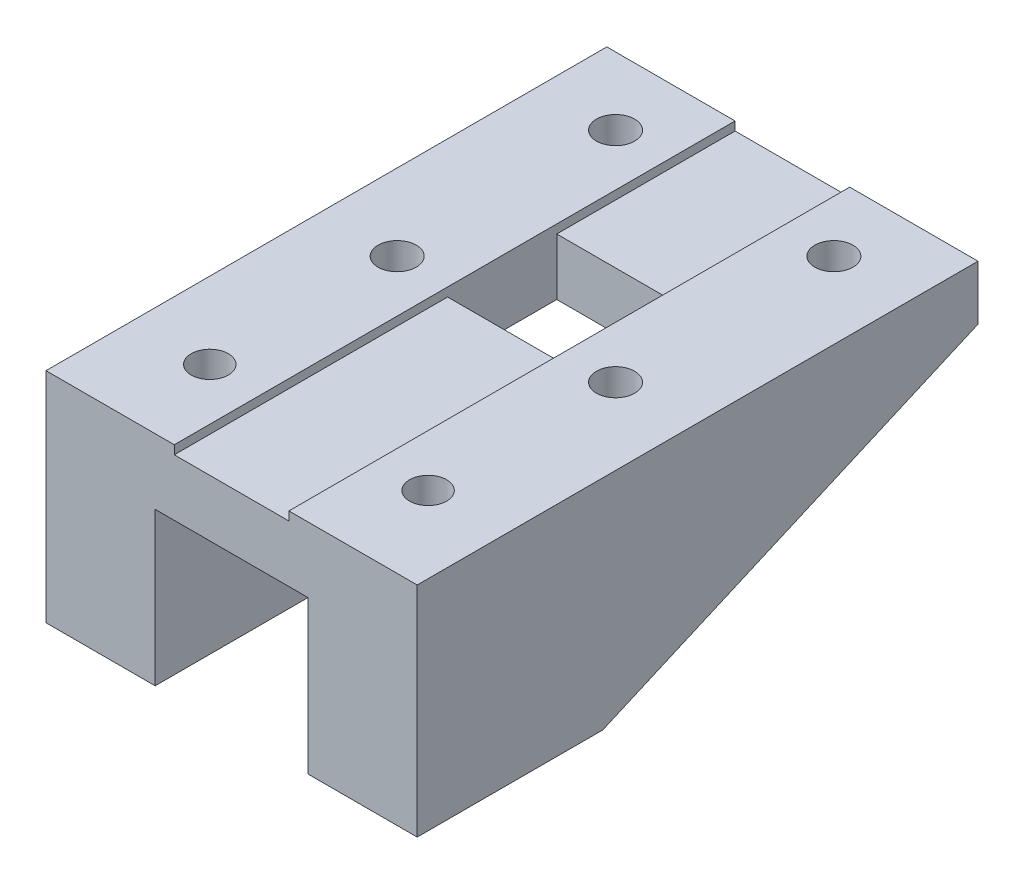
ISO-10303-21;
HEADER;
FILE_DESCRIPTION(('STEP AP214'),'2;1');
FILE_NAME('part.step','',(''),(''),'','','');
FILE_SCHEMA(('AUTOMOTIVE_DESIGN { 1 0 10303 214 1 1 1 1 }'));
ENDSEC;
DATA;
#1=APPLICATION_CONTEXT('core data for automotive mechanical design processes');
#2=APPLICATION_PROTOCOL_DEFINITION('international standard','automotive_design',2000,#1);
#3=PRODUCT_CONTEXT('',#1,'mechanical');
#4=PRODUCT('Part','Part','',(#3));
#5=PRODUCT_RELATED_PRODUCT_CATEGORY('part','',(#4));
#6=PRODUCT_DEFINITION_FORMATION('','',#4);
#7=PRODUCT_DEFINITION_CONTEXT('part definition',#1,'design');
#8=PRODUCT_DEFINITION('design','',#6,#7);
#9=PRODUCT_DEFINITION_SHAPE('','',#8);
#10=(LENGTH_UNIT() NAMED_UNIT(*) SI_UNIT(.MILLI.,.METRE.));
#11=(NAMED_UNIT(*) PLANE_ANGLE_UNIT() SI_UNIT($,.RADIAN.));
#12=(NAMED_UNIT(*) SI_UNIT($,.STERADIAN.) SOLID_ANGLE_UNIT());
#13=UNCERTAINTY_MEASURE_WITH_UNIT(LENGTH_MEASURE(1.E-05),#10,'distance_accuracy_value','');
#14=(GEOMETRIC_REPRESENTATION_CONTEXT(3) GLOBAL_UNCERTAINTY_ASSIGNED_CONTEXT((#13)) GLOBAL_UNIT_ASSIGNED_CONTEXT((#10,
#11,#12)) REPRESENTATION_CONTEXT('',''));
#15=CARTESIAN_POINT('',(0.,0.,0.));
#16=DIRECTION('',(0.,0.,1.));
#17=DIRECTION('',(1.,0.,0.));
#18=AXIS2_PLACEMENT_3D('',#15,#16,#17);
#19=CARTESIAN_POINT('',(-10.,142.,-122.46692088768));
#20=DIRECTION('',(0.,-1.,0.));
#21=DIRECTION('',(1.,0.,0.));
#22=AXIS2_PLACEMENT_3D('',#19,#20,#21);
#23=CYLINDRICAL_SURFACE('',#22,1.75);
#24=CARTESIAN_POINT('',(-10.,137.,-122.46692088768));
#25=DIRECTION('',(0.,1.,0.));
#26=DIRECTION('',(1.,0.,0.));
#27=AXIS2_PLACEMENT_3D('',#24,#25,#26);
#28=CIRCLE('',#27,1.75);
#29=CARTESIAN_POINT('',(-11.75,137.,-122.46692088768));
#30=VERTEX_POINT('',#29);
#31=EDGE_CURVE('E384',#30,#30,#28,.T.);
#32=ORIENTED_EDGE('',*,*,#31,.F.);
#33=DIRECTION('',(0.,1.,0.));
#34=VECTOR('',#33,1.);
#35=CARTESIAN_POINT('',(-11.75,142.,-122.46692088768));
#36=LINE('',#35,#34);
#37=CARTESIAN_POINT('',(-11.75,142.,-122.46692088768));
#38=VERTEX_POINT('',#37);
#39=EDGE_CURVE('E11',#30,#38,#36,.T.);
#40=ORIENTED_EDGE('',*,*,#39,.T.);
#41=CARTESIAN_POINT('',(-10.,142.,-122.46692088768));
#42=DIRECTION('',(0.,1.,0.));
#43=DIRECTION('',(1.,0.,0.));
#44=AXIS2_PLACEMENT_3D('',#41,#42,#43);
#45=CIRCLE('',#44,1.75);
#46=EDGE_CURVE('E486',#38,#38,#45,.T.);
#47=ORIENTED_EDGE('',*,*,#46,.T.);
#48=ORIENTED_EDGE('',*,*,#39,.F.);
#49=EDGE_LOOP('',(#32,#40,#47,#48));
#50=FACE_BOUND('',#49,.T.);
#51=ADVANCED_FACE('F16',(#50),#23,.F.);
#52=CARTESIAN_POINT('',(10.,142.,-142.46692088768));
#53=DIRECTION('',(0.,-1.,0.));
#54=DIRECTION('',(1.,0.,0.));
#55=AXIS2_PLACEMENT_3D('',#52,#53,#54);
#56=CYLINDRICAL_SURFACE('',#55,1.75);
#57=CARTESIAN_POINT('',(10.,137.,-142.46692088768));
#58=DIRECTION('',(0.,1.,0.));
#59=DIRECTION('',(1.,0.,0.));
#60=AXIS2_PLACEMENT_3D('',#57,#58,#59);
#61=CIRCLE('',#60,1.75);
#62=CARTESIAN_POINT('',(8.25,137.,-142.46692088768));
#63=VERTEX_POINT('',#62);
#64=EDGE_CURVE('E382',#63,#63,#61,.T.);
#65=ORIENTED_EDGE('',*,*,#64,.F.);
#66=DIRECTION('',(0.,1.,0.));
#67=VECTOR('',#66,1.);
#68=CARTESIAN_POINT('',(8.25,142.,-142.46692088768));
#69=LINE('',#68,#67);
#70=CARTESIAN_POINT('',(8.25,142.,-142.46692088768));
#71=VERTEX_POINT('',#70);
#72=EDGE_CURVE('E26',#63,#71,#69,.T.);
#73=ORIENTED_EDGE('',*,*,#72,.T.);
#74=CARTESIAN_POINT('',(10.,142.,-142.46692088768));
#75=DIRECTION('',(0.,1.,0.));
#76=DIRECTION('',(1.,0.,0.));
#77=AXIS2_PLACEMENT_3D('',#74,#75,#76);
#78=CIRCLE('',#77,1.75);
#79=EDGE_CURVE('E482',#71,#71,#78,.T.);
#80=ORIENTED_EDGE('',*,*,#79,.T.);
#81=ORIENTED_EDGE('',*,*,#72,.F.);
#82=EDGE_LOOP('',(#65,#73,#80,#81));
#83=FACE_BOUND('',#82,.T.);
#84=ADVANCED_FACE('F1242',(#83),#56,.F.);
#85=CARTESIAN_POINT('',(10.,142.,-122.46692088768));
#86=DIRECTION('',(0.,-1.,0.));
#87=DIRECTION('',(1.,0.,0.));
#88=AXIS2_PLACEMENT_3D('',#85,#86,#87);
#89=CYLINDRICAL_SURFACE('',#88,1.75);
#90=CARTESIAN_POINT('',(10.,137.,-122.46692088768));
#91=DIRECTION('',(0.,1.,0.));
#92=DIRECTION('',(1.,0.,0.));
#93=AXIS2_PLACEMENT_3D('',#90,#91,#92);
#94=CIRCLE('',#93,1.75);
#95=CARTESIAN_POINT('',(8.25,137.,-122.46692088768));
#96=VERTEX_POINT('',#95);
#97=EDGE_CURVE('E378',#96,#96,#94,.T.);
#98=ORIENTED_EDGE('',*,*,#97,.F.);
#99=DIRECTION('',(0.,1.,0.));
#100=VECTOR('',#99,1.);
#101=CARTESIAN_POINT('',(8.25,142.,-122.46692088768));
#102=LINE('',#101,#100);
#103=CARTESIAN_POINT('',(8.25,142.,-122.46692088768));
#104=VERTEX_POINT('',#103);
#105=EDGE_CURVE('E353',#96,#104,#102,.T.);
#106=ORIENTED_EDGE('',*,*,#105,.T.);
#107=CARTESIAN_POINT('',(10.,142.,-122.46692088768));
#108=DIRECTION('',(0.,1.,0.));
#109=DIRECTION('',(1.,0.,0.));
#110=AXIS2_PLACEMENT_3D('',#107,#108,#109);
#111=CIRCLE('',#110,1.75);
#112=EDGE_CURVE('E334',#104,#104,#111,.T.);
#113=ORIENTED_EDGE('',*,*,#112,.T.);
#114=ORIENTED_EDGE('',*,*,#105,.F.);
#115=EDGE_LOOP('',(#98,#106,#113,#114));
#116=FACE_BOUND('',#115,.T.);
#117=ADVANCED_FACE('F1236',(#116),#89,.F.);
#118=CARTESIAN_POINT('',(-10.,142.,-142.46692088768));
#119=DIRECTION('',(0.,-1.,0.));
#120=DIRECTION('',(1.,0.,0.));
#121=AXIS2_PLACEMENT_3D('',#118,#119,#120);
#122=CYLINDRICAL_SURFACE('',#121,1.75);
#123=CARTESIAN_POINT('',(-10.,137.,-142.46692088768));
#124=DIRECTION('',(0.,1.,0.));
#125=DIRECTION('',(1.,0.,0.));
#126=AXIS2_PLACEMENT_3D('',#123,#124,#125);
#127=CIRCLE('',#126,1.75);
#128=CARTESIAN_POINT('',(-11.75,137.,-142.46692088768));
#129=VERTEX_POINT('',#128);
#130=EDGE_CURVE('E359',#129,#129,#127,.T.);
#131=ORIENTED_EDGE('',*,*,#130,.F.);
#132=DIRECTION('',(0.,1.,0.));
#133=VECTOR('',#132,1.);
#134=CARTESIAN_POINT('',(-11.75,142.,-142.46692088768));
#135=LINE('',#134,#133);
#136=CARTESIAN_POINT('',(-11.75,142.,-142.46692088768));
#137=VERTEX_POINT('',#136);
#138=EDGE_CURVE('E323',#129,#137,#135,.T.);
#139=ORIENTED_EDGE('',*,*,#138,.T.);
#140=CARTESIAN_POINT('',(-10.,142.,-142.46692088768));
#141=DIRECTION('',(0.,1.,0.));
#142=DIRECTION('',(1.,0.,0.));
#143=AXIS2_PLACEMENT_3D('',#140,#141,#142);
#144=CIRCLE('',#143,1.75);
#145=EDGE_CURVE('E490',#137,#137,#144,.T.);
#146=ORIENTED_EDGE('',*,*,#145,.T.);
#147=ORIENTED_EDGE('',*,*,#138,.F.);
#148=EDGE_LOOP('',(#131,#139,#146,#147));
#149=FACE_BOUND('',#148,.T.);
#150=ADVANCED_FACE('F1241',(#149),#122,.F.);
#151=CARTESIAN_POINT('',(0.,141.2,-127.333461333067));
#152=DIRECTION('',(0.,-1.,0.));
#153=DIRECTION('',(0.,0.,-1.));
#154=AXIS2_PLACEMENT_3D('',#151,#152,#153);
#155=PLANE('',#154);
#156=DIRECTION('',(1.,0.,0.));
#157=VECTOR('',#156,1.);
#158=CARTESIAN_POINT('',(-2.525,141.2,-132.333461333067));
#159=LINE('',#158,#157);
#160=CARTESIAN_POINT('',(-5.25,141.2,-132.333461333067));
#161=VERTEX_POINT('',#160);
#162=CARTESIAN_POINT('',(5.25,141.2,-132.333461333067));
#163=VERTEX_POINT('',#162);
#164=EDGE_CURVE('E324',#161,#163,#159,.T.);
#165=ORIENTED_EDGE('',*,*,#164,.T.);
#166=DIRECTION('',(0.,0.,-1.));
#167=VECTOR('',#166,1.);
#168=CARTESIAN_POINT('',(5.25,141.2,-148.66692088768));
#169=LINE('',#168,#167);
#170=CARTESIAN_POINT('',(5.25,141.2,-148.66692088768));
#171=VERTEX_POINT('',#170);
#172=EDGE_CURVE('E345',#163,#171,#169,.T.);
#173=ORIENTED_EDGE('',*,*,#172,.T.);
#174=DIRECTION('',(1.,0.,0.));
#175=VECTOR('',#174,1.);
#176=CARTESIAN_POINT('',(-2.47499083755879,141.2,-148.66692088768));
#177=LINE('',#176,#175);
#178=CARTESIAN_POINT('',(-5.25,141.2,-148.66692088768));
#179=VERTEX_POINT('',#178);
#180=EDGE_CURVE('E403',#179,#171,#177,.T.);
#181=ORIENTED_EDGE('',*,*,#180,.F.);
#182=DIRECTION('',(0.,0.,1.));
#183=VECTOR('',#182,1.);
#184=CARTESIAN_POINT('',(-5.25,141.2,-106.000001778454));
#185=LINE('',#184,#183);
#186=EDGE_CURVE('E471',#179,#161,#185,.T.);
#187=ORIENTED_EDGE('',*,*,#186,.T.);
#188=EDGE_LOOP('',(#165,#173,#181,#187));
#189=FACE_BOUND('',#188,.T.);
#190=ADVANCED_FACE('F1073',(#189),#155,.F.);
#191=CARTESIAN_POINT('',(0.,141.2,-127.333461333067));
#192=DIRECTION('',(0.,-1.,0.));
#193=DIRECTION('',(0.,0.,-1.));
#194=AXIS2_PLACEMENT_3D('',#191,#192,#193);
#195=PLANE('',#194);
#196=DIRECTION('',(-1.,0.,0.));
#197=VECTOR('',#196,1.);
#198=CARTESIAN_POINT('',(2.525,141.2,-122.333461333067));
#199=LINE('',#198,#197);
#200=CARTESIAN_POINT('',(5.25,141.2,-122.333461333067));
#201=VERTEX_POINT('',#200);
#202=CARTESIAN_POINT('',(-5.25,141.2,-122.333461333067));
#203=VERTEX_POINT('',#202);
#204=EDGE_CURVE('E312',#201,#203,#199,.T.);
#205=ORIENTED_EDGE('',*,*,#204,.T.);
#206=DIRECTION('',(0.,0.,1.));
#207=VECTOR('',#206,1.);
#208=CARTESIAN_POINT('',(-5.25,141.2,-106.000001778454));
#209=LINE('',#208,#207);
#210=CARTESIAN_POINT('',(-5.25,141.2,-97.3000017784545));
#211=VERTEX_POINT('',#210);
#212=EDGE_CURVE('E449',#203,#211,#209,.T.);
#213=ORIENTED_EDGE('',*,*,#212,.T.);
#214=DIRECTION('',(-1.,0.,0.));
#215=VECTOR('',#214,1.);
#216=CARTESIAN_POINT('',(9.02500009685755,141.2,-97.3000017784545));
#217=LINE('',#216,#215);
#218=CARTESIAN_POINT('',(5.25,141.2,-97.3000017784545));
#219=VERTEX_POINT('',#218);
#220=EDGE_CURVE('E330',#219,#211,#217,.T.);
#221=ORIENTED_EDGE('',*,*,#220,.F.);
#222=DIRECTION('',(0.,0.,-1.));
#223=VECTOR('',#222,1.);
#224=CARTESIAN_POINT('',(5.25,141.2,-106.000001778454));
#225=LINE('',#224,#223);
#226=EDGE_CURVE('E327',#219,#201,#225,.T.);
#227=ORIENTED_EDGE('',*,*,#226,.T.);
#228=EDGE_LOOP('',(#205,#213,#221,#227));
#229=FACE_BOUND('',#228,.T.);
#230=ADVANCED_FACE('F328',(#229),#195,.F.);
#231=CARTESIAN_POINT('',(5.05,141.2,-122.333461333067));
#232=DIRECTION('',(0.,0.,1.));
#233=DIRECTION('',(1.,0.,0.));
#234=AXIS2_PLACEMENT_3D('',#231,#232,#233);
#235=PLANE('',#234);
#236=DIRECTION('',(0.,1.,0.));
#237=VECTOR('',#236,1.);
#238=CARTESIAN_POINT('',(-5.25,141.2,-122.333461333067));
#239=LINE('',#238,#237);
#240=CARTESIAN_POINT('',(-5.25,136.,-122.333461333067));
#241=VERTEX_POINT('',#240);
#242=EDGE_CURVE('E318',#241,#203,#239,.T.);
#243=ORIENTED_EDGE('',*,*,#242,.T.);
#244=ORIENTED_EDGE('',*,*,#204,.F.);
#245=DIRECTION('',(0.,-1.,0.));
#246=VECTOR('',#245,1.);
#247=CARTESIAN_POINT('',(5.25,137.,-122.333461333067));
#248=LINE('',#247,#246);
#249=CARTESIAN_POINT('',(5.25,136.,-122.333461333067));
#250=VERTEX_POINT('',#249);
#251=EDGE_CURVE('E317',#201,#250,#248,.T.);
#252=ORIENTED_EDGE('',*,*,#251,.T.);
#253=DIRECTION('',(1.,0.,0.));
#254=VECTOR('',#253,1.);
#255=CARTESIAN_POINT('',(-5.25,136.,-122.333461333067));
#256=LINE('',#255,#254);
#257=EDGE_CURVE('E485',#241,#250,#256,.T.);
#258=ORIENTED_EDGE('',*,*,#257,.F.);
#259=EDGE_LOOP('',(#243,#244,#252,#258));
#260=FACE_BOUND('',#259,.T.);
#261=ADVANCED_FACE('F314',(#260),#235,.F.);
#262=CARTESIAN_POINT('',(-5.05,141.2,-132.333461333067));
#263=DIRECTION('',(0.,0.,-1.));
#264=DIRECTION('',(0.,-1.,0.));
#265=AXIS2_PLACEMENT_3D('',#262,#263,#264);
#266=PLANE('',#265);
#267=DIRECTION('',(0.,1.,0.));
#268=VECTOR('',#267,1.);
#269=CARTESIAN_POINT('',(5.25,141.2,-132.333461333067));
#270=LINE('',#269,#268);
#271=CARTESIAN_POINT('',(5.25,136.,-132.333461333067));
#272=VERTEX_POINT('',#271);
#273=EDGE_CURVE('E265',#272,#163,#270,.T.);
#274=ORIENTED_EDGE('',*,*,#273,.T.);
#275=ORIENTED_EDGE('',*,*,#164,.F.);
#276=DIRECTION('',(0.,-1.,0.));
#277=VECTOR('',#276,1.);
#278=CARTESIAN_POINT('',(-5.25,137.,-132.333461333067));
#279=LINE('',#278,#277);
#280=CARTESIAN_POINT('',(-5.25,136.,-132.333461333067));
#281=VERTEX_POINT('',#280);
#282=EDGE_CURVE('E448',#161,#281,#279,.T.);
#283=ORIENTED_EDGE('',*,*,#282,.T.);
#284=DIRECTION('',(-1.,0.,0.));
#285=VECTOR('',#284,1.);
#286=CARTESIAN_POINT('',(5.25,136.,-132.333461333067));
#287=LINE('',#286,#285);
#288=EDGE_CURVE('E434',#272,#281,#287,.T.);
#289=ORIENTED_EDGE('',*,*,#288,.F.);
#290=EDGE_LOOP('',(#274,#275,#283,#289));
#291=FACE_BOUND('',#290,.T.);
#292=ADVANCED_FACE('F1152',(#291),#266,.F.);
#293=CARTESIAN_POINT('',(-10.0000001490116,122.,-108.300001778455));
#294=DIRECTION('',(0.,-1.,0.));
#295=DIRECTION('',(0.,0.,-1.));
#296=AXIS2_PLACEMENT_3D('',#293,#294,#295);
#297=PLANE('',#296);
#298=CARTESIAN_POINT('',(-10.0000001490116,122.,-105.300001778455));
#299=DIRECTION('',(0.,1.,0.));
#300=DIRECTION('',(1.,0.,0.));
#301=AXIS2_PLACEMENT_3D('',#298,#299,#300);
#302=CIRCLE('',#301,1.7);
#303=CARTESIAN_POINT('',(-11.7000001490116,122.,-105.300001778455));
#304=VERTEX_POINT('',#303);
#305=EDGE_CURVE('E430',#304,#304,#302,.T.);
#306=ORIENTED_EDGE('',*,*,#305,.T.);
#307=EDGE_LOOP('',(#306));
#308=FACE_BOUND('',#307,.T.);
#309=DIRECTION('',(-1.,0.,0.));
#310=VECTOR('',#309,1.);
#311=CARTESIAN_POINT('',(-13.0000001937151,122.,-114.300001778454));
#312=LINE('',#311,#310);
#313=CARTESIAN_POINT('',(-7.00000010430813,122.,-114.300001778454));
#314=VERTEX_POINT('',#313);
#315=CARTESIAN_POINT('',(-13.0000001937151,122.,-114.300001778454));
#316=VERTEX_POINT('',#315);
#317=EDGE_CURVE('E377',#314,#316,#312,.T.);
#318=ORIENTED_EDGE('',*,*,#317,.F.);
#319=DIRECTION('',(0.,0.,1.));
#320=VECTOR('',#319,1.);
#321=CARTESIAN_POINT('',(-7.00000010430813,122.,-102.300001778455));
#322=LINE('',#321,#320);
#323=CARTESIAN_POINT('',(-7.00000010430813,122.,-97.3000017784545));
#324=VERTEX_POINT('',#323);
#325=EDGE_CURVE('E360',#314,#324,#322,.T.);
#326=ORIENTED_EDGE('',*,*,#325,.T.);
#327=DIRECTION('',(-1.,0.,0.));
#328=VECTOR('',#327,1.);
#329=CARTESIAN_POINT('',(-13.0000001937151,122.,-97.3000017784545));
#330=LINE('',#329,#328);
#331=CARTESIAN_POINT('',(-17.0000001937151,122.,-97.3000017784545));
#332=VERTEX_POINT('',#331);
#333=EDGE_CURVE('E427',#324,#332,#330,.T.);
#334=ORIENTED_EDGE('',*,*,#333,.T.);
#335=DIRECTION('',(0.,0.,1.));
#336=VECTOR('',#335,1.);
#337=CARTESIAN_POINT('',(-17.0000001937151,122.,-102.300001778455));
#338=LINE('',#337,#336);
#339=CARTESIAN_POINT('',(-17.0000001937151,122.,-114.300001778454));
#340=VERTEX_POINT('',#339);
#341=EDGE_CURVE('E445',#340,#332,#338,.T.);
#342=ORIENTED_EDGE('',*,*,#341,.F.);
#343=DIRECTION('',(-1.,0.,0.));
#344=VECTOR('',#343,1.);
#345=CARTESIAN_POINT('',(-13.0000001937151,122.,-114.300001778454));
#346=LINE('',#345,#344);
#347=EDGE_CURVE('E450',#316,#340,#346,.T.);
#348=ORIENTED_EDGE('',*,*,#347,.F.);
#349=EDGE_LOOP('',(#318,#326,#334,#342,#348));
#350=FACE_BOUND('',#349,.T.);
#351=ADVANCED_FACE('F1143',(#308,#350),#297,.T.);
#352=CARTESIAN_POINT('',(10.0000001937151,122.,-108.300001778455));
#353=DIRECTION('',(0.,-1.,0.));
#354=DIRECTION('',(0.,0.,-1.));
#355=AXIS2_PLACEMENT_3D('',#352,#353,#354);
#356=PLANE('',#355);
#357=CARTESIAN_POINT('',(10.0000001937151,122.,-105.300001778455));
#358=DIRECTION('',(0.,1.,0.));
#359=DIRECTION('',(1.,0.,0.));
#360=AXIS2_PLACEMENT_3D('',#357,#358,#359);
#361=CIRCLE('',#360,1.7);
#362=CARTESIAN_POINT('',(8.30000019371511,122.,-105.300001778455));
#363=VERTEX_POINT('',#362);
#364=EDGE_CURVE('E628',#363,#363,#361,.T.);
#365=ORIENTED_EDGE('',*,*,#364,.T.);
#366=EDGE_LOOP('',(#365));
#367=FACE_BOUND('',#366,.T.);
#368=DIRECTION('',(1.,0.,0.));
#369=VECTOR('',#368,1.);
#370=CARTESIAN_POINT('',(13.0000001937151,122.,-97.3000017784545));
#371=LINE('',#370,#369);
#372=CARTESIAN_POINT('',(7.00000019371509,122.,-97.3000017784545));
#373=VERTEX_POINT('',#372);
#374=CARTESIAN_POINT('',(17.0000001937151,122.,-97.3000017784545));
#375=VERTEX_POINT('',#374);
#376=EDGE_CURVE('E423',#373,#375,#371,.T.);
#377=ORIENTED_EDGE('',*,*,#376,.F.);
#378=DIRECTION('',(0.,0.,1.));
#379=VECTOR('',#378,1.);
#380=CARTESIAN_POINT('',(7.0000001937151,122.,-102.300001778455));
#381=LINE('',#380,#379);
#382=CARTESIAN_POINT('',(7.0000001937151,122.,-114.300001778454));
#383=VERTEX_POINT('',#382);
#384=EDGE_CURVE('E398',#383,#373,#381,.T.);
#385=ORIENTED_EDGE('',*,*,#384,.F.);
#386=DIRECTION('',(1.,0.,0.));
#387=VECTOR('',#386,1.);
#388=CARTESIAN_POINT('',(7.0000001937151,122.,-114.300001778454));
#389=LINE('',#388,#387);
#390=CARTESIAN_POINT('',(12.9999998062849,122.,-114.300001778454));
#391=VERTEX_POINT('',#390);
#392=EDGE_CURVE('E358',#383,#391,#389,.T.);
#393=ORIENTED_EDGE('',*,*,#392,.T.);
#394=DIRECTION('',(1.,0.,0.));
#395=VECTOR('',#394,1.);
#396=CARTESIAN_POINT('',(7.0000001937151,122.,-114.300001778454));
#397=LINE('',#396,#395);
#398=CARTESIAN_POINT('',(17.0000001937151,122.,-114.300001778454));
#399=VERTEX_POINT('',#398);
#400=EDGE_CURVE('E454',#391,#399,#397,.T.);
#401=ORIENTED_EDGE('',*,*,#400,.T.);
#402=DIRECTION('',(0.,0.,-1.));
#403=VECTOR('',#402,1.);
#404=CARTESIAN_POINT('',(17.0000001937151,122.,-114.300001778454));
#405=LINE('',#404,#403);
#406=EDGE_CURVE('E137',#375,#399,#405,.T.);
#407=ORIENTED_EDGE('',*,*,#406,.F.);
#408=EDGE_LOOP('',(#377,#385,#393,#401,#407));
#409=FACE_BOUND('',#408,.T.);
#410=ADVANCED_FACE('F548',(#367,#409),#356,.T.);
#411=CARTESIAN_POINT('',(-10.0000001490116,122.,-105.300001778455));
#412=DIRECTION('',(0.,1.,0.));
#413=DIRECTION('',(1.,0.,0.));
#414=AXIS2_PLACEMENT_3D('',#411,#412,#413);
#415=CYLINDRICAL_SURFACE('',#414,1.7);
#416=ORIENTED_EDGE('',*,*,#305,.F.);
#417=DIRECTION('',(0.,1.,0.));
#418=VECTOR('',#417,1.);
#419=CARTESIAN_POINT('',(-11.7000001490116,122.,-105.300001778455));
#420=LINE('',#419,#418);
#421=CARTESIAN_POINT('',(-11.7000001490116,142.,-105.300001778455));
#422=VERTEX_POINT('',#421);
#423=EDGE_CURVE('E40',#304,#422,#420,.T.);
#424=ORIENTED_EDGE('',*,*,#423,.T.);
#425=CARTESIAN_POINT('',(-10.0000001490116,142.,-105.300001778455));
#426=DIRECTION('',(0.,-1.,0.));
#427=DIRECTION('',(1.,0.,0.));
#428=AXIS2_PLACEMENT_3D('',#425,#426,#427);
#429=CIRCLE('',#428,1.7);
#430=EDGE_CURVE('E611',#422,#422,#429,.T.);
#431=ORIENTED_EDGE('',*,*,#430,.F.);
#432=ORIENTED_EDGE('',*,*,#423,.F.);
#433=EDGE_LOOP('',(#416,#424,#431,#432));
#434=FACE_BOUND('',#433,.T.);
#435=ADVANCED_FACE('F1142',(#434),#415,.F.);
#436=CARTESIAN_POINT('',(10.0000001937151,122.,-105.300001778455));
#437=DIRECTION('',(0.,1.,0.));
#438=DIRECTION('',(1.,0.,0.));
#439=AXIS2_PLACEMENT_3D('',#436,#437,#438);
#440=CYLINDRICAL_SURFACE('',#439,1.7);
#441=ORIENTED_EDGE('',*,*,#364,.F.);
#442=DIRECTION('',(0.,1.,0.));
#443=VECTOR('',#442,1.);
#444=CARTESIAN_POINT('',(8.30000019371511,122.,-105.300001778455));
#445=LINE('',#444,#443);
#446=CARTESIAN_POINT('',(8.30000019371511,142.,-105.300001778455));
#447=VERTEX_POINT('',#446);
#448=EDGE_CURVE('E642',#363,#447,#445,.T.);
#449=ORIENTED_EDGE('',*,*,#448,.T.);
#450=CARTESIAN_POINT('',(10.0000001937151,142.,-105.300001778455));
#451=DIRECTION('',(0.,-1.,0.));
#452=DIRECTION('',(1.,0.,0.));
#453=AXIS2_PLACEMENT_3D('',#450,#451,#452);
#454=CIRCLE('',#453,1.7);
#455=EDGE_CURVE('E624',#447,#447,#454,.T.);
#456=ORIENTED_EDGE('',*,*,#455,.F.);
#457=ORIENTED_EDGE('',*,*,#448,.F.);
#458=EDGE_LOOP('',(#441,#449,#456,#457));
#459=FACE_BOUND('',#458,.T.);
#460=ADVANCED_FACE('F1130',(#459),#440,.F.);
#461=CARTESIAN_POINT('',(0.,142.,-127.333461333067));
#462=DIRECTION('',(0.,-1.,0.));
#463=DIRECTION('',(-1.,0.,0.));
#464=AXIS2_PLACEMENT_3D('',#461,#462,#463);
#465=PLANE('',#464);
#466=ORIENTED_EDGE('',*,*,#455,.T.);
#467=EDGE_LOOP('',(#466));
#468=FACE_BOUND('',#467,.T.);
#469=ORIENTED_EDGE('',*,*,#79,.F.);
#470=EDGE_LOOP('',(#469));
#471=FACE_BOUND('',#470,.T.);
#472=ORIENTED_EDGE('',*,*,#112,.F.);
#473=EDGE_LOOP('',(#472));
#474=FACE_BOUND('',#473,.T.);
#475=DIRECTION('',(0.,0.,1.));
#476=VECTOR('',#475,1.);
#477=CARTESIAN_POINT('',(5.25,142.,-138.000191110373));
#478=LINE('',#477,#476);
#479=CARTESIAN_POINT('',(5.25,142.,-148.66692088768));
#480=VERTEX_POINT('',#479);
#481=CARTESIAN_POINT('',(5.25,142.,-97.3000017784545));
#482=VERTEX_POINT('',#481);
#483=EDGE_CURVE('E513',#480,#482,#478,.T.);
#484=ORIENTED_EDGE('',*,*,#483,.T.);
#485=DIRECTION('',(1.,0.,0.));
#486=VECTOR('',#485,1.);
#487=CARTESIAN_POINT('',(13.0000001937151,142.,-97.3000017784545));
#488=LINE('',#487,#486);
#489=CARTESIAN_POINT('',(17.0000001937151,142.,-97.3000017784545));
#490=VERTEX_POINT('',#489);
#491=EDGE_CURVE('E426',#482,#490,#488,.T.);
#492=ORIENTED_EDGE('',*,*,#491,.T.);
#493=DIRECTION('',(0.,0.,1.));
#494=VECTOR('',#493,1.);
#495=CARTESIAN_POINT('',(17.0000001937151,142.,-132.46692088768));
#496=LINE('',#495,#494);
#497=CARTESIAN_POINT('',(17.0000001937151,142.,-132.46692088768));
#498=VERTEX_POINT('',#497);
#499=EDGE_CURVE('E433',#498,#490,#496,.T.);
#500=ORIENTED_EDGE('',*,*,#499,.F.);
#501=DIRECTION('',(0.,0.,1.));
#502=VECTOR('',#501,1.);
#503=CARTESIAN_POINT('',(17.0000001937151,142.,-132.46692088768));
#504=LINE('',#503,#502);
#505=CARTESIAN_POINT('',(17.0000001937151,142.,-148.66692088768));
#506=VERTEX_POINT('',#505);
#507=EDGE_CURVE('E506',#506,#498,#504,.T.);
#508=ORIENTED_EDGE('',*,*,#507,.F.);
#509=DIRECTION('',(-1.,0.,0.));
#510=VECTOR('',#509,1.);
#511=CARTESIAN_POINT('',(-12.8999816751176,142.,-148.66692088768));
#512=LINE('',#511,#510);
#513=EDGE_CURVE('E402',#506,#480,#512,.T.);
#514=ORIENTED_EDGE('',*,*,#513,.T.);
#515=EDGE_LOOP('',(#484,#492,#500,#508,#514));
#516=FACE_BOUND('',#515,.T.);
#517=ADVANCED_FACE('F538',(#468,#471,#474,#516),#465,.F.);
#518=CARTESIAN_POINT('',(5.25,142.,-148.66692088768));
#519=DIRECTION('',(1.,0.,0.));
#520=DIRECTION('',(0.,1.,0.));
#521=AXIS2_PLACEMENT_3D('',#518,#519,#520);
#522=PLANE('',#521);
#523=ORIENTED_EDGE('',*,*,#483,.F.);
#524=DIRECTION('',(0.,1.,0.));
#525=VECTOR('',#524,1.);
#526=CARTESIAN_POINT('',(5.25,142.,-148.66692088768));
#527=LINE('',#526,#525);
#528=EDGE_CURVE('E399',#171,#480,#527,.T.);
#529=ORIENTED_EDGE('',*,*,#528,.F.);
#530=ORIENTED_EDGE('',*,*,#172,.F.);
#531=ORIENTED_EDGE('',*,*,#273,.F.);
#532=DIRECTION('',(0.,0.,-1.));
#533=VECTOR('',#532,1.);
#534=CARTESIAN_POINT('',(5.25,136.,-122.333461333067));
#535=LINE('',#534,#533);
#536=EDGE_CURVE('E337',#250,#272,#535,.T.);
#537=ORIENTED_EDGE('',*,*,#536,.F.);
#538=ORIENTED_EDGE('',*,*,#251,.F.);
#539=ORIENTED_EDGE('',*,*,#226,.F.);
#540=DIRECTION('',(0.,-1.,0.));
#541=VECTOR('',#540,1.);
#542=CARTESIAN_POINT('',(5.25,142.,-97.3000017784545));
#543=LINE('',#542,#541);
#544=EDGE_CURVE('E465',#482,#219,#543,.T.);
#545=ORIENTED_EDGE('',*,*,#544,.F.);
#546=EDGE_LOOP('',(#523,#529,#530,#531,#537,#538,#539,#545));
#547=FACE_BOUND('',#546,.T.);
#548=ADVANCED_FACE('F336',(#547),#522,.F.);
#549=CARTESIAN_POINT('',(0.100018324882418,142.,-148.66692088768));
#550=DIRECTION('',(0.,0.,-1.));
#551=DIRECTION('',(-1.,0.,0.));
#552=AXIS2_PLACEMENT_3D('',#549,#550,#551);
#553=PLANE('',#552);
#554=DIRECTION('',(-1.,0.,0.));
#555=VECTOR('',#554,1.);
#556=CARTESIAN_POINT('',(-12.8999816751176,137.,-148.66692088768));
#557=LINE('',#556,#555);
#558=CARTESIAN_POINT('',(17.,137.,-148.66692088768));
#559=VERTEX_POINT('',#558);
#560=CARTESIAN_POINT('',(-17.0000001937151,137.,-148.66692088768));
#561=VERTEX_POINT('',#560);
#562=EDGE_CURVE('E492',#559,#561,#557,.T.);
#563=ORIENTED_EDGE('',*,*,#562,.T.);
#564=DIRECTION('',(0.,1.,0.));
#565=VECTOR('',#564,1.);
#566=CARTESIAN_POINT('',(-17.0000001937151,142.,-148.66692088768));
#567=LINE('',#566,#565);
#568=CARTESIAN_POINT('',(-17.0000001937151,142.,-148.66692088768));
#569=VERTEX_POINT('',#568);
#570=EDGE_CURVE('E516',#569,#561,#567,.F.);
#571=ORIENTED_EDGE('',*,*,#570,.F.);
#572=DIRECTION('',(-1.,0.,0.));
#573=VECTOR('',#572,1.);
#574=CARTESIAN_POINT('',(-12.8999816751176,142.,-148.66692088768));
#575=LINE('',#574,#573);
#576=CARTESIAN_POINT('',(-5.25,142.,-148.66692088768));
#577=VERTEX_POINT('',#576);
#578=EDGE_CURVE('E491',#577,#569,#575,.T.);
#579=ORIENTED_EDGE('',*,*,#578,.F.);
#580=DIRECTION('',(0.,-1.,0.));
#581=VECTOR('',#580,1.);
#582=CARTESIAN_POINT('',(-5.25,142.,-148.66692088768));
#583=LINE('',#582,#581);
#584=EDGE_CURVE('E470',#577,#179,#583,.T.);
#585=ORIENTED_EDGE('',*,*,#584,.T.);
#586=ORIENTED_EDGE('',*,*,#180,.T.);
#587=ORIENTED_EDGE('',*,*,#528,.T.);
#588=ORIENTED_EDGE('',*,*,#513,.F.);
#589=DIRECTION('',(0.,1.,0.));
#590=VECTOR('',#589,1.);
#591=CARTESIAN_POINT('',(17.0000001937151,142.,-148.66692088768));
#592=LINE('',#591,#590);
#593=EDGE_CURVE('E19',#559,#506,#592,.T.);
#594=ORIENTED_EDGE('',*,*,#593,.F.);
#595=EDGE_LOOP('',(#563,#571,#579,#585,#586,#587,#588,#594));
#596=FACE_BOUND('',#595,.T.);
#597=ADVANCED_FACE('F534',(#596),#553,.T.);
#598=CARTESIAN_POINT('',(0.,142.,-127.333461333067));
#599=DIRECTION('',(0.,-1.,0.));
#600=DIRECTION('',(-1.,0.,0.));
#601=AXIS2_PLACEMENT_3D('',#598,#599,#600);
#602=PLANE('',#601);
#603=ORIENTED_EDGE('',*,*,#430,.T.);
#604=EDGE_LOOP('',(#603));
#605=FACE_BOUND('',#604,.T.);
#606=ORIENTED_EDGE('',*,*,#145,.F.);
#607=EDGE_LOOP('',(#606));
#608=FACE_BOUND('',#607,.T.);
#609=ORIENTED_EDGE('',*,*,#46,.F.);
#610=EDGE_LOOP('',(#609));
#611=FACE_BOUND('',#610,.T.);
#612=DIRECTION('',(0.,0.,-1.));
#613=VECTOR('',#612,1.);
#614=CARTESIAN_POINT('',(-5.25,142.,-116.666731555761));
#615=LINE('',#614,#613);
#616=CARTESIAN_POINT('',(-5.25,142.,-97.3000017784545));
#617=VERTEX_POINT('',#616);
#618=EDGE_CURVE('E444',#617,#577,#615,.T.);
#619=ORIENTED_EDGE('',*,*,#618,.T.);
#620=ORIENTED_EDGE('',*,*,#578,.T.);
#621=DIRECTION('',(0.,0.,1.));
#622=VECTOR('',#621,1.);
#623=CARTESIAN_POINT('',(-17.0000001937151,142.,-106.000001778454));
#624=LINE('',#623,#622);
#625=CARTESIAN_POINT('',(-17.0000001937151,142.,-132.46692088768));
#626=VERTEX_POINT('',#625);
#627=EDGE_CURVE('E505',#626,#569,#624,.F.);
#628=ORIENTED_EDGE('',*,*,#627,.F.);
#629=DIRECTION('',(0.,0.,-1.));
#630=VECTOR('',#629,1.);
#631=CARTESIAN_POINT('',(-17.0000001937151,142.,-106.000001778454));
#632=LINE('',#631,#630);
#633=CARTESIAN_POINT('',(-17.0000001937151,142.,-97.3000017784545));
#634=VERTEX_POINT('',#633);
#635=EDGE_CURVE('E501',#634,#626,#632,.T.);
#636=ORIENTED_EDGE('',*,*,#635,.F.);
#637=DIRECTION('',(-1.,0.,0.));
#638=VECTOR('',#637,1.);
#639=CARTESIAN_POINT('',(13.0000001937151,142.,-97.3000017784545));
#640=LINE('',#639,#638);
#641=EDGE_CURVE('E455',#617,#634,#640,.T.);
#642=ORIENTED_EDGE('',*,*,#641,.F.);
#643=EDGE_LOOP('',(#619,#620,#628,#636,#642));
#644=FACE_BOUND('',#643,.T.);
#645=ADVANCED_FACE('F564',(#605,#608,#611,#644),#602,.F.);
#646=CARTESIAN_POINT('',(13.0000001937151,142.,-97.3000017784545));
#647=DIRECTION('',(0.,0.,1.));
#648=DIRECTION('',(1.,0.,0.));
#649=AXIS2_PLACEMENT_3D('',#646,#647,#648);
#650=PLANE('',#649);
#651=ORIENTED_EDGE('',*,*,#220,.T.);
#652=DIRECTION('',(0.,1.,0.));
#653=VECTOR('',#652,1.);
#654=CARTESIAN_POINT('',(-5.25,142.,-97.3000017784545));
#655=LINE('',#654,#653);
#656=EDGE_CURVE('E570',#211,#617,#655,.T.);
#657=ORIENTED_EDGE('',*,*,#656,.T.);
#658=ORIENTED_EDGE('',*,*,#641,.T.);
#659=DIRECTION('',(0.,1.,0.));
#660=VECTOR('',#659,1.);
#661=CARTESIAN_POINT('',(-17.0000001937151,142.,-97.3000017784545));
#662=LINE('',#661,#660);
#663=EDGE_CURVE('E440',#332,#634,#662,.T.);
#664=ORIENTED_EDGE('',*,*,#663,.F.);
#665=ORIENTED_EDGE('',*,*,#333,.F.);
#666=DIRECTION('',(0.,1.,0.));
#667=VECTOR('',#666,1.);
#668=CARTESIAN_POINT('',(-7.00000010430813,137.,-97.3000017784545));
#669=LINE('',#668,#667);
#670=CARTESIAN_POINT('',(-7.00000010430813,136.,-97.3000017784545));
#671=VERTEX_POINT('',#670);
#672=EDGE_CURVE('E365',#324,#671,#669,.T.);
#673=ORIENTED_EDGE('',*,*,#672,.T.);
#674=DIRECTION('',(-1.,0.,0.));
#675=VECTOR('',#674,1.);
#676=CARTESIAN_POINT('',(7.00000019371509,136.,-97.3000017784545));
#677=LINE('',#676,#675);
#678=CARTESIAN_POINT('',(7.00000019371509,136.,-97.3000017784545));
#679=VERTEX_POINT('',#678);
#680=EDGE_CURVE('E414',#679,#671,#677,.T.);
#681=ORIENTED_EDGE('',*,*,#680,.F.);
#682=DIRECTION('',(0.,-1.,0.));
#683=VECTOR('',#682,1.);
#684=CARTESIAN_POINT('',(7.0000001937151,137.,-97.3000017784545));
#685=LINE('',#684,#683);
#686=EDGE_CURVE('E383',#679,#373,#685,.T.);
#687=ORIENTED_EDGE('',*,*,#686,.T.);
#688=ORIENTED_EDGE('',*,*,#376,.T.);
#689=DIRECTION('',(0.,-1.,0.));
#690=VECTOR('',#689,1.);
#691=CARTESIAN_POINT('',(17.0000001937151,137.,-97.3000017784545));
#692=LINE('',#691,#690);
#693=EDGE_CURVE('E368',#490,#375,#692,.T.);
#694=ORIENTED_EDGE('',*,*,#693,.F.);
#695=ORIENTED_EDGE('',*,*,#491,.F.);
#696=ORIENTED_EDGE('',*,*,#544,.T.);
#697=EDGE_LOOP('',(#651,#657,#658,#664,#665,#673,#681,#687,#688,#694,#695,#696));
#698=FACE_BOUND('',#697,.T.);
#699=ADVANCED_FACE('F542',(#698),#650,.T.);
#700=CARTESIAN_POINT('',(-5.25,142.,-106.000001778454));
#701=DIRECTION('',(-1.,0.,0.));
#702=DIRECTION('',(0.,0.,1.));
#703=AXIS2_PLACEMENT_3D('',#700,#701,#702);
#704=PLANE('',#703);
#705=ORIENTED_EDGE('',*,*,#618,.F.);
#706=ORIENTED_EDGE('',*,*,#656,.F.);
#707=ORIENTED_EDGE('',*,*,#212,.F.);
#708=ORIENTED_EDGE('',*,*,#242,.F.);
#709=DIRECTION('',(0.,0.,1.));
#710=VECTOR('',#709,1.);
#711=CARTESIAN_POINT('',(-5.25,136.,-132.333461333067));
#712=LINE('',#711,#710);
#713=EDGE_CURVE('E438',#281,#241,#712,.T.);
#714=ORIENTED_EDGE('',*,*,#713,.F.);
#715=ORIENTED_EDGE('',*,*,#282,.F.);
#716=ORIENTED_EDGE('',*,*,#186,.F.);
#717=ORIENTED_EDGE('',*,*,#584,.F.);
#718=EDGE_LOOP('',(#705,#706,#707,#708,#714,#715,#716,#717));
#719=FACE_BOUND('',#718,.T.);
#720=ADVANCED_FACE('F1260',(#719),#704,.F.);
#721=CARTESIAN_POINT('',(-17.0000001937151,142.,-106.000001778454));
#722=DIRECTION('',(-1.,0.,0.));
#723=DIRECTION('',(0.,0.,1.));
#724=AXIS2_PLACEMENT_3D('',#721,#722,#723);
#725=PLANE('',#724);
#726=ORIENTED_EDGE('',*,*,#635,.T.);
#727=ORIENTED_EDGE('',*,*,#627,.T.);
#728=ORIENTED_EDGE('',*,*,#570,.T.);
#729=DIRECTION('',(0.,0.400023450373501,-0.916504904051953));
#730=VECTOR('',#729,1.);
#731=CARTESIAN_POINT('',(-17.0000001937151,122.,-114.300001778454));
#732=LINE('',#731,#730);
#733=EDGE_CURVE('E388',#340,#561,#732,.T.);
#734=ORIENTED_EDGE('',*,*,#733,.F.);
#735=ORIENTED_EDGE('',*,*,#341,.T.);
#736=ORIENTED_EDGE('',*,*,#663,.T.);
#737=EDGE_LOOP('',(#726,#727,#728,#734,#735,#736));
#738=FACE_BOUND('',#737,.T.);
#739=ADVANCED_FACE('F560',(#738),#725,.T.);
#740=CARTESIAN_POINT('',(17.0000001937151,142.,-132.46692088768));
#741=DIRECTION('',(1.,0.,0.));
#742=DIRECTION('',(0.,1.,0.));
#743=AXIS2_PLACEMENT_3D('',#740,#741,#742);
#744=PLANE('',#743);
#745=ORIENTED_EDGE('',*,*,#499,.T.);
#746=ORIENTED_EDGE('',*,*,#693,.T.);
#747=ORIENTED_EDGE('',*,*,#406,.T.);
#748=DIRECTION('',(0.,0.400023450373501,-0.916504904051953));
#749=VECTOR('',#748,1.);
#750=CARTESIAN_POINT('',(16.9999998062849,122.,-114.300001778454));
#751=LINE('',#750,#749);
#752=EDGE_CURVE('E495',#399,#559,#751,.T.);
#753=ORIENTED_EDGE('',*,*,#752,.T.);
#754=ORIENTED_EDGE('',*,*,#593,.T.);
#755=ORIENTED_EDGE('',*,*,#507,.T.);
#756=EDGE_LOOP('',(#745,#746,#747,#753,#754,#755));
#757=FACE_BOUND('',#756,.T.);
#758=ADVANCED_FACE('F529',(#757),#744,.T.);
#759=CARTESIAN_POINT('',(-17.0000001937151,122.,-114.300001778454));
#760=DIRECTION('',(0.,-0.916504904051953,-0.400023450373501));
#761=DIRECTION('',(0.,0.400023450373501,-0.916504904051953));
#762=AXIS2_PLACEMENT_3D('',#759,#760,#761);
#763=PLANE('',#762);
#764=ORIENTED_EDGE('',*,*,#733,.T.);
#765=ORIENTED_EDGE('',*,*,#562,.F.);
#766=ORIENTED_EDGE('',*,*,#752,.F.);
#767=ORIENTED_EDGE('',*,*,#400,.F.);
#768=DIRECTION('',(0.,0.400023450373501,-0.916504904051953));
#769=VECTOR('',#768,1.);
#770=CARTESIAN_POINT('',(12.9999998062849,125.75,-122.891731555761));
#771=LINE('',#770,#769);
#772=CARTESIAN_POINT('',(12.9999998062849,136.,-146.375792947065));
#773=VERTEX_POINT('',#772);
#774=EDGE_CURVE('E389',#391,#773,#771,.T.);
#775=ORIENTED_EDGE('',*,*,#774,.T.);
#776=DIRECTION('',(1.,0.,0.));
#777=VECTOR('',#776,1.);
#778=CARTESIAN_POINT('',(-6.5000001937151,136.,-146.375792947065));
#779=LINE('',#778,#777);
#780=CARTESIAN_POINT('',(-13.0000001937151,136.,-146.375792947065));
#781=VERTEX_POINT('',#780);
#782=EDGE_CURVE('E651',#781,#773,#779,.T.);
#783=ORIENTED_EDGE('',*,*,#782,.F.);
#784=DIRECTION('',(0.,0.400023450373501,-0.916504904051953));
#785=VECTOR('',#784,1.);
#786=CARTESIAN_POINT('',(-13.0000001937151,122.,-114.300001778454));
#787=LINE('',#786,#785);
#788=EDGE_CURVE('E376',#316,#781,#787,.T.);
#789=ORIENTED_EDGE('',*,*,#788,.F.);
#790=ORIENTED_EDGE('',*,*,#347,.T.);
#791=EDGE_LOOP('',(#764,#765,#766,#767,#775,#783,#789,#790));
#792=FACE_BOUND('',#791,.T.);
#793=ADVANCED_FACE('F554',(#792),#763,.T.);
#794=CARTESIAN_POINT('',(0.,137.,-127.333461333067));
#795=DIRECTION('',(0.,-1.,0.));
#796=DIRECTION('',(-1.,0.,0.));
#797=AXIS2_PLACEMENT_3D('',#794,#795,#796);
#798=PLANE('',#797);
#799=ORIENTED_EDGE('',*,*,#31,.T.);
#800=EDGE_LOOP('',(#799));
#801=FACE_BOUND('',#800,.T.);
#802=CARTESIAN_POINT('',(-10.,137.,-122.46692088768));
#803=DIRECTION('',(0.,-1.,0.));
#804=DIRECTION('',(1.,0.,0.));
#805=AXIS2_PLACEMENT_3D('',#802,#803,#804);
#806=CIRCLE('',#805,3.00000019371516);
#807=CARTESIAN_POINT('',(-13.0000001937151,137.,-122.46692088768));
#808=VERTEX_POINT('',#807);
#809=EDGE_CURVE('E349',#808,#808,#806,.T.);
#810=ORIENTED_EDGE('',*,*,#809,.T.);
#811=EDGE_LOOP('',(#810));
#812=FACE_BOUND('',#811,.T.);
#813=ADVANCED_FACE('F1002',(#801,#812),#798,.T.);
#814=CARTESIAN_POINT('',(12.9999998062849,129.5,-131.483461333067));
#815=DIRECTION('',(1.,0.,0.));
#816=DIRECTION('',(0.,1.,0.));
#817=AXIS2_PLACEMENT_3D('',#814,#815,#816);
#818=PLANE('',#817);
#819=DIRECTION('',(0.,0.,-1.));
#820=VECTOR('',#819,1.);
#821=CARTESIAN_POINT('',(12.9999998062849,136.,-127.233461333067));
#822=LINE('',#821,#820);
#823=CARTESIAN_POINT('',(12.9999998062849,136.,-142.46692088768));
#824=VERTEX_POINT('',#823);
#825=EDGE_CURVE('E478',#824,#773,#822,.T.);
#826=ORIENTED_EDGE('',*,*,#825,.T.);
#827=ORIENTED_EDGE('',*,*,#774,.F.);
#828=DIRECTION('',(0.,-1.,0.));
#829=VECTOR('',#828,1.);
#830=CARTESIAN_POINT('',(12.9999998062849,133.25,-114.300001778454));
#831=LINE('',#830,#829);
#832=CARTESIAN_POINT('',(12.9999998062849,136.,-114.300001778454));
#833=VERTEX_POINT('',#832);
#834=EDGE_CURVE('E354',#833,#391,#831,.T.);
#835=ORIENTED_EDGE('',*,*,#834,.F.);
#836=DIRECTION('',(0.,0.,-1.));
#837=VECTOR('',#836,1.);
#838=CARTESIAN_POINT('',(12.9999998062849,136.,-127.233461333067));
#839=LINE('',#838,#837);
#840=CARTESIAN_POINT('',(12.9999998062849,136.,-122.46692088768));
#841=VERTEX_POINT('',#840);
#842=EDGE_CURVE('E601',#833,#841,#839,.T.);
#843=ORIENTED_EDGE('',*,*,#842,.T.);
#844=DIRECTION('',(0.,0.,-1.));
#845=VECTOR('',#844,1.);
#846=CARTESIAN_POINT('',(12.9999998062849,136.,-127.233461333067));
#847=LINE('',#846,#845);
#848=EDGE_CURVE('E409',#841,#824,#847,.T.);
#849=ORIENTED_EDGE('',*,*,#848,.T.);
#850=EDGE_LOOP('',(#826,#827,#835,#843,#849));
#851=FACE_BOUND('',#850,.T.);
#852=ADVANCED_FACE('F1084',(#851),#818,.F.);
#853=CARTESIAN_POINT('',(7.0000001937151,137.,-114.300001778454));
#854=DIRECTION('',(0.,0.,-1.));
#855=DIRECTION('',(0.,-1.,0.));
#856=AXIS2_PLACEMENT_3D('',#853,#854,#855);
#857=PLANE('',#856);
#858=DIRECTION('',(1.,0.,0.));
#859=VECTOR('',#858,1.);
#860=CARTESIAN_POINT('',(3.5,136.,-114.300001778454));
#861=LINE('',#860,#859);
#862=CARTESIAN_POINT('',(7.00000019371509,136.,-114.300001778454));
#863=VERTEX_POINT('',#862);
#864=EDGE_CURVE('E597',#863,#833,#861,.T.);
#865=ORIENTED_EDGE('',*,*,#864,.T.);
#866=ORIENTED_EDGE('',*,*,#834,.T.);
#867=ORIENTED_EDGE('',*,*,#392,.F.);
#868=DIRECTION('',(0.,-1.,0.));
#869=VECTOR('',#868,1.);
#870=CARTESIAN_POINT('',(7.0000001937151,137.,-114.300001778454));
#871=LINE('',#870,#869);
#872=EDGE_CURVE('E364',#863,#383,#871,.T.);
#873=ORIENTED_EDGE('',*,*,#872,.F.);
#874=EDGE_LOOP('',(#865,#866,#867,#873));
#875=FACE_BOUND('',#874,.T.);
#876=ADVANCED_FACE('F1189',(#875),#857,.T.);
#877=CARTESIAN_POINT('',(0.,137.,-127.333461333067));
#878=DIRECTION('',(0.,-1.,0.));
#879=DIRECTION('',(-1.,0.,0.));
#880=AXIS2_PLACEMENT_3D('',#877,#878,#879);
#881=PLANE('',#880);
#882=ORIENTED_EDGE('',*,*,#130,.T.);
#883=EDGE_LOOP('',(#882));
#884=FACE_BOUND('',#883,.T.);
#885=CARTESIAN_POINT('',(-10.,137.,-142.46692088768));
#886=DIRECTION('',(0.,-1.,0.));
#887=DIRECTION('',(1.,0.,0.));
#888=AXIS2_PLACEMENT_3D('',#885,#886,#887);
#889=CIRCLE('',#888,3.00000019371517);
#890=CARTESIAN_POINT('',(-13.0000001937151,137.,-142.46692088768));
#891=VERTEX_POINT('',#890);
#892=EDGE_CURVE('E371',#891,#891,#889,.T.);
#893=ORIENTED_EDGE('',*,*,#892,.T.);
#894=EDGE_LOOP('',(#893));
#895=FACE_BOUND('',#894,.T.);
#896=ADVANCED_FACE('F1108',(#884,#895),#881,.T.);
#897=CARTESIAN_POINT('',(0.,137.,-127.333461333067));
#898=DIRECTION('',(0.,-1.,0.));
#899=DIRECTION('',(-1.,0.,0.));
#900=AXIS2_PLACEMENT_3D('',#897,#898,#899);
#901=PLANE('',#900);
#902=ORIENTED_EDGE('',*,*,#64,.T.);
#903=EDGE_LOOP('',(#902));
#904=FACE_BOUND('',#903,.T.);
#905=CARTESIAN_POINT('',(10.,137.,-142.46692088768));
#906=DIRECTION('',(0.,-1.,0.));
#907=DIRECTION('',(1.,0.,0.));
#908=AXIS2_PLACEMENT_3D('',#905,#906,#907);
#909=CIRCLE('',#908,2.99999980628484);
#910=CARTESIAN_POINT('',(7.00000019371523,137.,-142.46692088768));
#911=VERTEX_POINT('',#910);
#912=EDGE_CURVE('E372',#911,#911,#909,.T.);
#913=ORIENTED_EDGE('',*,*,#912,.T.);
#914=EDGE_LOOP('',(#913));
#915=FACE_BOUND('',#914,.T.);
#916=ADVANCED_FACE('F1103',(#904,#915),#901,.T.);
#917=CARTESIAN_POINT('',(0.,137.,-127.333461333067));
#918=DIRECTION('',(0.,-1.,0.));
#919=DIRECTION('',(-1.,0.,0.));
#920=AXIS2_PLACEMENT_3D('',#917,#918,#919);
#921=PLANE('',#920);
#922=ORIENTED_EDGE('',*,*,#97,.T.);
#923=EDGE_LOOP('',(#922));
#924=FACE_BOUND('',#923,.T.);
#925=CARTESIAN_POINT('',(10.,137.,-122.46692088768));
#926=DIRECTION('',(0.,-1.,0.));
#927=DIRECTION('',(1.,0.,0.));
#928=AXIS2_PLACEMENT_3D('',#925,#926,#927);
#929=CIRCLE('',#928,2.99999980628484);
#930=CARTESIAN_POINT('',(7.00000019371523,137.,-122.46692088768));
#931=VERTEX_POINT('',#930);
#932=EDGE_CURVE('E462',#931,#931,#929,.T.);
#933=ORIENTED_EDGE('',*,*,#932,.T.);
#934=EDGE_LOOP('',(#933));
#935=FACE_BOUND('',#934,.T.);
#936=ADVANCED_FACE('F1040',(#924,#935),#921,.T.);
#937=CARTESIAN_POINT('',(7.0000001937151,137.,-102.300001778455));
#938=DIRECTION('',(-1.,0.,0.));
#939=DIRECTION('',(0.,1.,0.));
#940=AXIS2_PLACEMENT_3D('',#937,#938,#939);
#941=PLANE('',#940);
#942=DIRECTION('',(0.,0.,-1.));
#943=VECTOR('',#942,1.);
#944=CARTESIAN_POINT('',(7.0000001937151,136.,-112.641731555761));
#945=LINE('',#944,#943);
#946=EDGE_CURVE('E419',#679,#863,#945,.T.);
#947=ORIENTED_EDGE('',*,*,#946,.T.);
#948=ORIENTED_EDGE('',*,*,#872,.T.);
#949=ORIENTED_EDGE('',*,*,#384,.T.);
#950=ORIENTED_EDGE('',*,*,#686,.F.);
#951=EDGE_LOOP('',(#947,#948,#949,#950));
#952=FACE_BOUND('',#951,.T.);
#953=ADVANCED_FACE('F1034',(#952),#941,.T.);
#954=CARTESIAN_POINT('',(-7.00000010430813,137.,-114.300001778454));
#955=DIRECTION('',(1.,0.,0.));
#956=DIRECTION('',(0.,0.,-1.));
#957=AXIS2_PLACEMENT_3D('',#954,#955,#956);
#958=PLANE('',#957);
#959=DIRECTION('',(0.,0.,1.));
#960=VECTOR('',#959,1.);
#961=CARTESIAN_POINT('',(-7.00000010430813,136.,-118.641731555761));
#962=LINE('',#961,#960);
#963=CARTESIAN_POINT('',(-7.00000010430813,136.,-114.300001778454));
#964=VERTEX_POINT('',#963);
#965=EDGE_CURVE('E418',#964,#671,#962,.T.);
#966=ORIENTED_EDGE('',*,*,#965,.T.);
#967=ORIENTED_EDGE('',*,*,#672,.F.);
#968=ORIENTED_EDGE('',*,*,#325,.F.);
#969=DIRECTION('',(0.,-1.,0.));
#970=VECTOR('',#969,1.);
#971=CARTESIAN_POINT('',(-7.00000010430813,137.,-114.300001778454));
#972=LINE('',#971,#970);
#973=EDGE_CURVE('E458',#964,#314,#972,.T.);
#974=ORIENTED_EDGE('',*,*,#973,.F.);
#975=EDGE_LOOP('',(#966,#967,#968,#974));
#976=FACE_BOUND('',#975,.T.);
#977=ADVANCED_FACE('F1039',(#976),#958,.T.);
#978=CARTESIAN_POINT('',(-13.0000001937151,129.5,-131.483461333067));
#979=DIRECTION('',(1.,0.,0.));
#980=DIRECTION('',(0.,1.,0.));
#981=AXIS2_PLACEMENT_3D('',#978,#979,#980);
#982=PLANE('',#981);
#983=DIRECTION('',(0.,0.,1.));
#984=VECTOR('',#983,1.);
#985=CARTESIAN_POINT('',(-13.0000001937151,136.,-127.233461333067));
#986=LINE('',#985,#984);
#987=CARTESIAN_POINT('',(-13.0000001937151,136.,-122.46692088768));
#988=VERTEX_POINT('',#987);
#989=CARTESIAN_POINT('',(-13.0000001937151,136.,-114.300001778454));
#990=VERTEX_POINT('',#989);
#991=EDGE_CURVE('E631',#988,#990,#986,.T.);
#992=ORIENTED_EDGE('',*,*,#991,.T.);
#993=DIRECTION('',(0.,1.,0.));
#994=VECTOR('',#993,1.);
#995=CARTESIAN_POINT('',(-13.0000001937151,133.25,-114.300001778454));
#996=LINE('',#995,#994);
#997=EDGE_CURVE('E373',#316,#990,#996,.T.);
#998=ORIENTED_EDGE('',*,*,#997,.F.);
#999=ORIENTED_EDGE('',*,*,#788,.T.);
#1000=DIRECTION('',(0.,0.,1.));
#1001=VECTOR('',#1000,1.);
#1002=CARTESIAN_POINT('',(-13.0000001937151,136.,-127.233461333067));
#1003=LINE('',#1002,#1001);
#1004=CARTESIAN_POINT('',(-13.0000001937151,136.,-142.46692088768));
#1005=VERTEX_POINT('',#1004);
#1006=EDGE_CURVE('E439',#781,#1005,#1003,.T.);
#1007=ORIENTED_EDGE('',*,*,#1006,.T.);
#1008=DIRECTION('',(0.,0.,1.));
#1009=VECTOR('',#1008,1.);
#1010=CARTESIAN_POINT('',(-13.0000001937151,136.,-127.233461333067));
#1011=LINE('',#1010,#1009);
#1012=EDGE_CURVE('E592',#1005,#988,#1011,.T.);
#1013=ORIENTED_EDGE('',*,*,#1012,.T.);
#1014=EDGE_LOOP('',(#992,#998,#999,#1007,#1013));
#1015=FACE_BOUND('',#1014,.T.);
#1016=ADVANCED_FACE('F988',(#1015),#982,.T.);
#1017=CARTESIAN_POINT('',(-13.0000001937151,137.,-114.300001778454));
#1018=DIRECTION('',(0.,0.,-1.));
#1019=DIRECTION('',(0.,-1.,0.));
#1020=AXIS2_PLACEMENT_3D('',#1017,#1018,#1019);
#1021=PLANE('',#1020);
#1022=DIRECTION('',(1.,0.,0.));
#1023=VECTOR('',#1022,1.);
#1024=CARTESIAN_POINT('',(-6.5000001937151,136.,-114.300001778454));
#1025=LINE('',#1024,#1023);
#1026=EDGE_CURVE('E636',#990,#964,#1025,.T.);
#1027=ORIENTED_EDGE('',*,*,#1026,.T.);
#1028=ORIENTED_EDGE('',*,*,#973,.T.);
#1029=ORIENTED_EDGE('',*,*,#317,.T.);
#1030=ORIENTED_EDGE('',*,*,#997,.T.);
#1031=EDGE_LOOP('',(#1027,#1028,#1029,#1030));
#1032=FACE_BOUND('',#1031,.T.);
#1033=ADVANCED_FACE('F981',(#1032),#1021,.T.);
#1034=CARTESIAN_POINT('',(10.,137.,-122.46692088768));
#1035=DIRECTION('',(0.,-1.,0.));
#1036=DIRECTION('',(1.,0.,0.));
#1037=AXIS2_PLACEMENT_3D('',#1034,#1035,#1036);
#1038=CYLINDRICAL_SURFACE('',#1037,2.99999980628484);
#1039=CARTESIAN_POINT('',(10.,136.,-122.46692088768));
#1040=DIRECTION('',(0.,1.,0.));
#1041=DIRECTION('',(1.,0.,0.));
#1042=AXIS2_PLACEMENT_3D('',#1039,#1040,#1041);
#1043=CIRCLE('',#1042,2.99999980628484);
#1044=CARTESIAN_POINT('',(7.00000019371523,136.,-122.46692088768));
#1045=VERTEX_POINT('',#1044);
#1046=EDGE_CURVE('E422',#841,#1045,#1043,.T.);
#1047=ORIENTED_EDGE('',*,*,#1046,.F.);
#1048=CARTESIAN_POINT('',(10.,136.,-122.46692088768));
#1049=DIRECTION('',(0.,1.,0.));
#1050=DIRECTION('',(1.,0.,0.));
#1051=AXIS2_PLACEMENT_3D('',#1048,#1049,#1050);
#1052=CIRCLE('',#1051,2.99999980628484);
#1053=EDGE_CURVE('E607',#1045,#841,#1052,.T.);
#1054=ORIENTED_EDGE('',*,*,#1053,.F.);
#1055=DIRECTION('',(0.,1.,0.));
#1056=VECTOR('',#1055,1.);
#1057=CARTESIAN_POINT('',(7.00000019371523,137.,-122.46692088768));
#1058=LINE('',#1057,#1056);
#1059=EDGE_CURVE('E586',#1045,#931,#1058,.T.);
#1060=ORIENTED_EDGE('',*,*,#1059,.T.);
#1061=ORIENTED_EDGE('',*,*,#932,.F.);
#1062=ORIENTED_EDGE('',*,*,#1059,.F.);
#1063=EDGE_LOOP('',(#1047,#1054,#1060,#1061,#1062));
#1064=FACE_BOUND('',#1063,.T.);
#1065=ADVANCED_FACE('F987',(#1064),#1038,.F.);
#1066=CARTESIAN_POINT('',(-10.,137.,-122.46692088768));
#1067=DIRECTION('',(0.,-1.,0.));
#1068=DIRECTION('',(1.,0.,0.));
#1069=AXIS2_PLACEMENT_3D('',#1066,#1067,#1068);
#1070=CYLINDRICAL_SURFACE('',#1069,3.00000019371516);
#1071=CARTESIAN_POINT('',(-10.,136.,-122.46692088768));
#1072=DIRECTION('',(0.,1.,0.));
#1073=DIRECTION('',(1.,0.,0.));
#1074=AXIS2_PLACEMENT_3D('',#1071,#1072,#1073);
#1075=CIRCLE('',#1074,3.00000019371516);
#1076=EDGE_CURVE('E635',#988,#988,#1075,.T.);
#1077=ORIENTED_EDGE('',*,*,#1076,.F.);
#1078=DIRECTION('',(0.,1.,0.));
#1079=VECTOR('',#1078,1.);
#1080=CARTESIAN_POINT('',(-13.0000001937151,137.,-122.46692088768));
#1081=LINE('',#1080,#1079);
#1082=EDGE_CURVE('E618',#988,#808,#1081,.T.);
#1083=ORIENTED_EDGE('',*,*,#1082,.T.);
#1084=ORIENTED_EDGE('',*,*,#809,.F.);
#1085=ORIENTED_EDGE('',*,*,#1082,.F.);
#1086=EDGE_LOOP('',(#1077,#1083,#1084,#1085));
#1087=FACE_BOUND('',#1086,.T.);
#1088=ADVANCED_FACE('F1116',(#1087),#1070,.F.);
#1089=CARTESIAN_POINT('',(-10.,137.,-142.46692088768));
#1090=DIRECTION('',(0.,-1.,0.));
#1091=DIRECTION('',(1.,0.,0.));
#1092=AXIS2_PLACEMENT_3D('',#1089,#1090,#1091);
#1093=CYLINDRICAL_SURFACE('',#1092,3.00000019371517);
#1094=CARTESIAN_POINT('',(-10.,136.,-142.46692088768));
#1095=DIRECTION('',(0.,1.,0.));
#1096=DIRECTION('',(1.,0.,0.));
#1097=AXIS2_PLACEMENT_3D('',#1094,#1095,#1096);
#1098=CIRCLE('',#1097,3.00000019371517);
#1099=EDGE_CURVE('E588',#1005,#1005,#1098,.T.);
#1100=ORIENTED_EDGE('',*,*,#1099,.F.);
#1101=DIRECTION('',(0.,1.,0.));
#1102=VECTOR('',#1101,1.);
#1103=CARTESIAN_POINT('',(-13.0000001937151,137.,-142.46692088768));
#1104=LINE('',#1103,#1102);
#1105=EDGE_CURVE('E275',#1005,#891,#1104,.T.);
#1106=ORIENTED_EDGE('',*,*,#1105,.T.);
#1107=ORIENTED_EDGE('',*,*,#892,.F.);
#1108=ORIENTED_EDGE('',*,*,#1105,.F.);
#1109=EDGE_LOOP('',(#1100,#1106,#1107,#1108));
#1110=FACE_BOUND('',#1109,.T.);
#1111=ADVANCED_FACE('F1095',(#1110),#1093,.F.);
#1112=CARTESIAN_POINT('',(10.,137.,-142.46692088768));
#1113=DIRECTION('',(0.,-1.,0.));
#1114=DIRECTION('',(1.,0.,0.));
#1115=AXIS2_PLACEMENT_3D('',#1112,#1113,#1114);
#1116=CYLINDRICAL_SURFACE('',#1115,2.99999980628484);
#1117=CARTESIAN_POINT('',(10.,136.,-142.46692088768));
#1118=DIRECTION('',(0.,1.,0.));
#1119=DIRECTION('',(1.,0.,0.));
#1120=AXIS2_PLACEMENT_3D('',#1117,#1118,#1119);
#1121=CIRCLE('',#1120,2.99999980628484);
#1122=CARTESIAN_POINT('',(7.00000019371523,136.,-142.46692088768));
#1123=VERTEX_POINT('',#1122);
#1124=EDGE_CURVE('E410',#824,#1123,#1121,.T.);
#1125=ORIENTED_EDGE('',*,*,#1124,.F.);
#1126=CARTESIAN_POINT('',(10.,136.,-142.46692088768));
#1127=DIRECTION('',(0.,1.,0.));
#1128=DIRECTION('',(1.,0.,0.));
#1129=AXIS2_PLACEMENT_3D('',#1126,#1127,#1128);
#1130=CIRCLE('',#1129,2.99999980628484);
#1131=EDGE_CURVE('E405',#1123,#824,#1130,.T.);
#1132=ORIENTED_EDGE('',*,*,#1131,.F.);
#1133=DIRECTION('',(0.,1.,0.));
#1134=VECTOR('',#1133,1.);
#1135=CARTESIAN_POINT('',(7.00000019371523,137.,-142.46692088768));
#1136=LINE('',#1135,#1134);
#1137=EDGE_CURVE('E394',#1123,#911,#1136,.T.);
#1138=ORIENTED_EDGE('',*,*,#1137,.T.);
#1139=ORIENTED_EDGE('',*,*,#912,.F.);
#1140=ORIENTED_EDGE('',*,*,#1137,.F.);
#1141=EDGE_LOOP('',(#1125,#1132,#1138,#1139,#1140));
#1142=FACE_BOUND('',#1141,.T.);
#1143=ADVANCED_FACE('F1026',(#1142),#1116,.F.);
#1144=CARTESIAN_POINT('',(-1.93715096108091E-07,136.,-122.983461333067));
#1145=DIRECTION('',(0.,-1.,0.));
#1146=DIRECTION('',(-1.,0.,0.));
#1147=AXIS2_PLACEMENT_3D('',#1144,#1145,#1146);
#1148=PLANE('',#1147);
#1149=ORIENTED_EDGE('',*,*,#288,.T.);
#1150=ORIENTED_EDGE('',*,*,#713,.T.);
#1151=ORIENTED_EDGE('',*,*,#257,.T.);
#1152=ORIENTED_EDGE('',*,*,#536,.T.);
#1153=EDGE_LOOP('',(#1149,#1150,#1151,#1152));
#1154=FACE_BOUND('',#1153,.T.);
#1155=ORIENTED_EDGE('',*,*,#782,.T.);
#1156=ORIENTED_EDGE('',*,*,#825,.F.);
#1157=ORIENTED_EDGE('',*,*,#1124,.T.);
#1158=ORIENTED_EDGE('',*,*,#1131,.T.);
#1159=ORIENTED_EDGE('',*,*,#848,.F.);
#1160=ORIENTED_EDGE('',*,*,#1046,.T.);
#1161=ORIENTED_EDGE('',*,*,#1053,.T.);
#1162=ORIENTED_EDGE('',*,*,#842,.F.);
#1163=ORIENTED_EDGE('',*,*,#864,.F.);
#1164=ORIENTED_EDGE('',*,*,#946,.F.);
#1165=ORIENTED_EDGE('',*,*,#680,.T.);
#1166=ORIENTED_EDGE('',*,*,#965,.F.);
#1167=ORIENTED_EDGE('',*,*,#1026,.F.);
#1168=ORIENTED_EDGE('',*,*,#991,.F.);
#1169=ORIENTED_EDGE('',*,*,#1076,.T.);
#1170=ORIENTED_EDGE('',*,*,#1012,.F.);
#1171=ORIENTED_EDGE('',*,*,#1099,.T.);
#1172=ORIENTED_EDGE('',*,*,#1006,.F.);
#1173=EDGE_LOOP('',(#1155,#1156,#1157,#1158,#1159,#1160,#1161,#1162,#1163,#1164,#1165,#1166,
#1167,#1168,#1169,#1170,#1171,#1172));
#1174=FACE_BOUND('',#1173,.T.);
#1175=ADVANCED_FACE('F1021',(#1154,#1174),#1148,.T.);
#1176=CLOSED_SHELL('',(#51,#84,#117,#150,#190,#230,#261,#292,#351,#410,#435,#460,#517,#548,#597,
#645,#699,#720,#739,#758,#793,#813,#852,#876,#896,#916,#936,#953,#977,#1016,#1033,#1065,#1088,
#1111,#1143,#1175));
#1177=MANIFOLD_SOLID_BREP('B1',#1176);
#1178=ADVANCED_BREP_SHAPE_REPRESENTATION('',(#18,#1177),#14);
#1179=SHAPE_DEFINITION_REPRESENTATION(#9,#1178);
ENDSEC;
END-ISO-10303-21;
